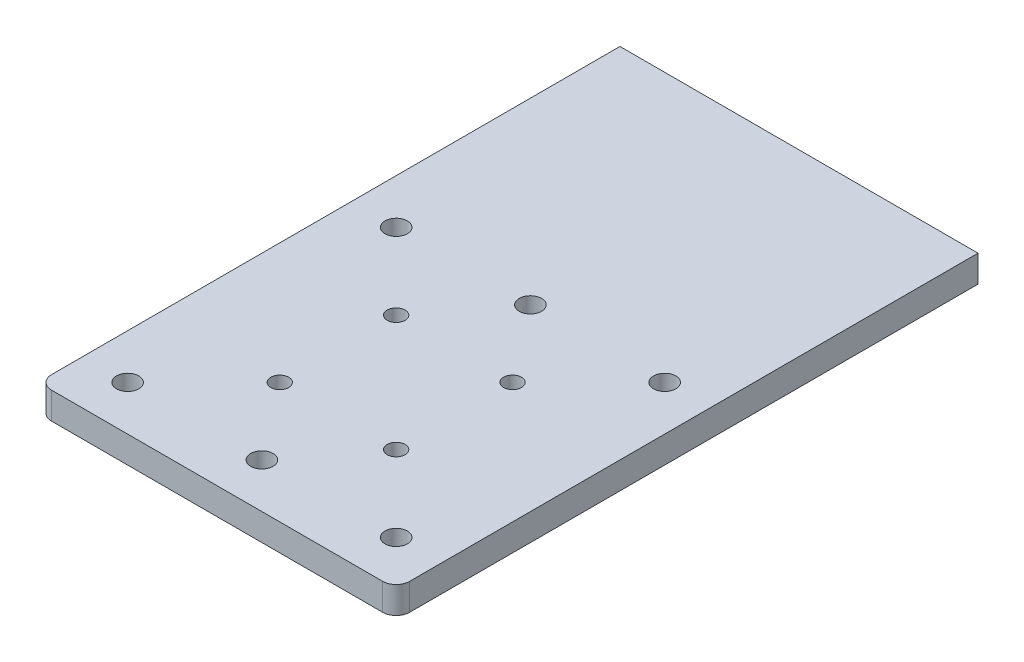
ISO-10303-21;
HEADER;
FILE_DESCRIPTION(('STEP AP214'),'2;1');
FILE_NAME('part.step','',(''),(''),'','','');
FILE_SCHEMA(('AUTOMOTIVE_DESIGN { 1 0 10303 214 1 1 1 1 }'));
ENDSEC;
DATA;
#1=APPLICATION_CONTEXT('core data for automotive mechanical design processes');
#2=APPLICATION_PROTOCOL_DEFINITION('international standard','automotive_design',2000,#1);
#3=PRODUCT_CONTEXT('',#1,'mechanical');
#4=PRODUCT('Part','Part','',(#3));
#5=PRODUCT_RELATED_PRODUCT_CATEGORY('part','',(#4));
#6=PRODUCT_DEFINITION_FORMATION('','',#4);
#7=PRODUCT_DEFINITION_CONTEXT('part definition',#1,'design');
#8=PRODUCT_DEFINITION('design','',#6,#7);
#9=PRODUCT_DEFINITION_SHAPE('','',#8);
#10=(LENGTH_UNIT() NAMED_UNIT(*) SI_UNIT(.MILLI.,.METRE.));
#11=(NAMED_UNIT(*) PLANE_ANGLE_UNIT() SI_UNIT($,.RADIAN.));
#12=(NAMED_UNIT(*) SI_UNIT($,.STERADIAN.) SOLID_ANGLE_UNIT());
#13=UNCERTAINTY_MEASURE_WITH_UNIT(LENGTH_MEASURE(1.E-05),#10,'distance_accuracy_value','');
#14=(GEOMETRIC_REPRESENTATION_CONTEXT(3) GLOBAL_UNCERTAINTY_ASSIGNED_CONTEXT((#13)) GLOBAL_UNIT_ASSIGNED_CONTEXT((#10,
#11,#12)) REPRESENTATION_CONTEXT('',''));
#15=CARTESIAN_POINT('',(0.,0.,0.));
#16=DIRECTION('',(0.,0.,1.));
#17=DIRECTION('',(1.,0.,0.));
#18=AXIS2_PLACEMENT_3D('',#15,#16,#17);
#19=CARTESIAN_POINT('',(0.,6.,0.));
#20=DIRECTION('',(0.,1.,0.));
#21=DIRECTION('',(0.,0.,1.));
#22=AXIS2_PLACEMENT_3D('',#19,#20,#21);
#23=PLANE('',#22);
#24=CARTESIAN_POINT('',(13.,6.,-43.));
#25=DIRECTION('',(0.,1.,0.));
#26=DIRECTION('',(0.,0.,1.));
#27=AXIS2_PLACEMENT_3D('',#24,#25,#26);
#28=CIRCLE('',#27,2.5);
#29=CARTESIAN_POINT('',(13.,6.,-40.5));
#30=VERTEX_POINT('',#29);
#31=EDGE_CURVE('E192',#30,#30,#28,.T.);
#32=ORIENTED_EDGE('',*,*,#31,.F.);
#33=EDGE_LOOP('',(#32));
#34=FACE_BOUND('',#33,.T.);
#35=CARTESIAN_POINT('',(43.,6.,17.));
#36=DIRECTION('',(0.,1.,0.));
#37=DIRECTION('',(0.,0.,1.));
#38=AXIS2_PLACEMENT_3D('',#35,#36,#37);
#39=CIRCLE('',#38,2.5);
#40=CARTESIAN_POINT('',(43.,6.,19.5));
#41=VERTEX_POINT('',#40);
#42=EDGE_CURVE('E180',#41,#41,#39,.T.);
#43=ORIENTED_EDGE('',*,*,#42,.F.);
#44=EDGE_LOOP('',(#43));
#45=FACE_BOUND('',#44,.T.);
#46=CARTESIAN_POINT('',(-17.,6.,-43.));
#47=DIRECTION('',(0.,1.,0.));
#48=DIRECTION('',(0.,0.,1.));
#49=AXIS2_PLACEMENT_3D('',#46,#47,#48);
#50=CIRCLE('',#49,2.5);
#51=CARTESIAN_POINT('',(-17.,6.,-40.5));
#52=VERTEX_POINT('',#51);
#53=EDGE_CURVE('E168',#52,#52,#50,.T.);
#54=ORIENTED_EDGE('',*,*,#53,.F.);
#55=EDGE_LOOP('',(#54));
#56=FACE_BOUND('',#55,.T.);
#57=CARTESIAN_POINT('',(26.,6.,0.));
#58=DIRECTION('',(0.,1.,0.));
#59=DIRECTION('',(0.,0.,1.));
#60=AXIS2_PLACEMENT_3D('',#57,#58,#59);
#61=CIRCLE('',#60,2.);
#62=CARTESIAN_POINT('',(26.,6.,2.));
#63=VERTEX_POINT('',#62);
#64=EDGE_CURVE('E156',#63,#63,#61,.T.);
#65=ORIENTED_EDGE('',*,*,#64,.F.);
#66=EDGE_LOOP('',(#65));
#67=FACE_BOUND('',#66,.T.);
#68=CARTESIAN_POINT('',(0.,6.,-26.));
#69=DIRECTION('',(0.,1.,0.));
#70=DIRECTION('',(0.,0.,1.));
#71=AXIS2_PLACEMENT_3D('',#68,#69,#70);
#72=CIRCLE('',#71,2.);
#73=CARTESIAN_POINT('',(0.,6.,-24.));
#74=VERTEX_POINT('',#73);
#75=EDGE_CURVE('E119',#74,#74,#72,.T.);
#76=ORIENTED_EDGE('',*,*,#75,.F.);
#77=EDGE_LOOP('',(#76));
#78=FACE_BOUND('',#77,.T.);
#79=DIRECTION('',(1.,0.,0.));
#80=VECTOR('',#79,1.);
#81=CARTESIAN_POINT('',(-27.,6.,27.));
#82=LINE('',#81,#80);
#83=CARTESIAN_POINT('',(-24.,6.,27.));
#84=VERTEX_POINT('',#83);
#85=CARTESIAN_POINT('',(50.,6.,27.));
#86=VERTEX_POINT('',#85);
#87=EDGE_CURVE('E98',#84,#86,#82,.T.);
#88=ORIENTED_EDGE('',*,*,#87,.T.);
#89=CARTESIAN_POINT('',(50.,6.,24.));
#90=DIRECTION('',(0.,1.,0.));
#91=DIRECTION('',(0.,0.,1.));
#92=AXIS2_PLACEMENT_3D('',#89,#90,#91);
#93=CIRCLE('',#92,3.);
#94=CARTESIAN_POINT('',(53.,6.,24.));
#95=VERTEX_POINT('',#94);
#96=EDGE_CURVE('E42',#86,#95,#93,.T.);
#97=ORIENTED_EDGE('',*,*,#96,.T.);
#98=DIRECTION('',(0.,0.,-1.));
#99=VECTOR('',#98,1.);
#100=CARTESIAN_POINT('',(53.,6.,-103.));
#101=LINE('',#100,#99);
#102=CARTESIAN_POINT('',(53.,6.,-103.));
#103=VERTEX_POINT('',#102);
#104=EDGE_CURVE('E88',#95,#103,#101,.T.);
#105=ORIENTED_EDGE('',*,*,#104,.T.);
#106=DIRECTION('',(-1.,0.,0.));
#107=VECTOR('',#106,1.);
#108=CARTESIAN_POINT('',(-27.,6.,-103.));
#109=LINE('',#108,#107);
#110=CARTESIAN_POINT('',(-27.,6.,-103.));
#111=VERTEX_POINT('',#110);
#112=EDGE_CURVE('E92',#103,#111,#109,.T.);
#113=ORIENTED_EDGE('',*,*,#112,.T.);
#114=DIRECTION('',(0.,0.,1.));
#115=VECTOR('',#114,1.);
#116=CARTESIAN_POINT('',(-27.,6.,-103.));
#117=LINE('',#116,#115);
#118=CARTESIAN_POINT('',(-27.,6.,24.));
#119=VERTEX_POINT('',#118);
#120=EDGE_CURVE('E123',#111,#119,#117,.T.);
#121=ORIENTED_EDGE('',*,*,#120,.T.);
#122=CARTESIAN_POINT('',(-24.,6.,24.));
#123=DIRECTION('',(0.,1.,0.));
#124=DIRECTION('',(0.,0.,1.));
#125=AXIS2_PLACEMENT_3D('',#122,#123,#124);
#126=CIRCLE('',#125,3.);
#127=EDGE_CURVE('E134',#119,#84,#126,.T.);
#128=ORIENTED_EDGE('',*,*,#127,.T.);
#129=EDGE_LOOP('',(#88,#97,#105,#113,#121,#128));
#130=FACE_BOUND('',#129,.T.);
#131=CARTESIAN_POINT('',(26.,6.,-26.));
#132=DIRECTION('',(0.,1.,0.));
#133=DIRECTION('',(0.,0.,1.));
#134=AXIS2_PLACEMENT_3D('',#131,#132,#133);
#135=CIRCLE('',#134,2.);
#136=CARTESIAN_POINT('',(26.,6.,-24.));
#137=VERTEX_POINT('',#136);
#138=EDGE_CURVE('E150',#137,#137,#135,.T.);
#139=ORIENTED_EDGE('',*,*,#138,.F.);
#140=EDGE_LOOP('',(#139));
#141=FACE_BOUND('',#140,.T.);
#142=CARTESIAN_POINT('',(0.,6.,0.));
#143=DIRECTION('',(0.,1.,0.));
#144=DIRECTION('',(0.,0.,1.));
#145=AXIS2_PLACEMENT_3D('',#142,#143,#144);
#146=CIRCLE('',#145,2.);
#147=CARTESIAN_POINT('',(0.,6.,2.));
#148=VERTEX_POINT('',#147);
#149=EDGE_CURVE('E162',#148,#148,#146,.T.);
#150=ORIENTED_EDGE('',*,*,#149,.F.);
#151=EDGE_LOOP('',(#150));
#152=FACE_BOUND('',#151,.T.);
#153=CARTESIAN_POINT('',(43.,6.,-43.));
#154=DIRECTION('',(0.,1.,0.));
#155=DIRECTION('',(0.,0.,1.));
#156=AXIS2_PLACEMENT_3D('',#153,#154,#155);
#157=CIRCLE('',#156,2.5);
#158=CARTESIAN_POINT('',(43.,6.,-40.5));
#159=VERTEX_POINT('',#158);
#160=EDGE_CURVE('E174',#159,#159,#157,.T.);
#161=ORIENTED_EDGE('',*,*,#160,.F.);
#162=EDGE_LOOP('',(#161));
#163=FACE_BOUND('',#162,.T.);
#164=CARTESIAN_POINT('',(-17.,6.,17.));
#165=DIRECTION('',(0.,1.,0.));
#166=DIRECTION('',(0.,0.,1.));
#167=AXIS2_PLACEMENT_3D('',#164,#165,#166);
#168=CIRCLE('',#167,2.5);
#169=CARTESIAN_POINT('',(-17.,6.,19.5));
#170=VERTEX_POINT('',#169);
#171=EDGE_CURVE('E186',#170,#170,#168,.T.);
#172=ORIENTED_EDGE('',*,*,#171,.F.);
#173=EDGE_LOOP('',(#172));
#174=FACE_BOUND('',#173,.T.);
#175=CARTESIAN_POINT('',(13.,6.,17.));
#176=DIRECTION('',(0.,1.,0.));
#177=DIRECTION('',(0.,0.,1.));
#178=AXIS2_PLACEMENT_3D('',#175,#176,#177);
#179=CIRCLE('',#178,2.5);
#180=CARTESIAN_POINT('',(13.,6.,19.5));
#181=VERTEX_POINT('',#180);
#182=EDGE_CURVE('E198',#181,#181,#179,.T.);
#183=ORIENTED_EDGE('',*,*,#182,.F.);
#184=EDGE_LOOP('',(#183));
#185=FACE_BOUND('',#184,.T.);
#186=ADVANCED_FACE('F34',(#34,#45,#56,#67,#78,#130,#141,#152,#163,#174,#185),#23,.T.);
#187=CARTESIAN_POINT('',(0.,0.,0.));
#188=DIRECTION('',(0.,1.,0.));
#189=DIRECTION('',(0.,0.,1.));
#190=AXIS2_PLACEMENT_3D('',#187,#188,#189);
#191=PLANE('',#190);
#192=CARTESIAN_POINT('',(13.,0.,-43.));
#193=DIRECTION('',(0.,1.,0.));
#194=DIRECTION('',(0.,0.,1.));
#195=AXIS2_PLACEMENT_3D('',#192,#193,#194);
#196=CIRCLE('',#195,2.5);
#197=CARTESIAN_POINT('',(13.,0.,-40.5));
#198=VERTEX_POINT('',#197);
#199=EDGE_CURVE('E195',#198,#198,#196,.T.);
#200=ORIENTED_EDGE('',*,*,#199,.T.);
#201=EDGE_LOOP('',(#200));
#202=FACE_BOUND('',#201,.T.);
#203=CARTESIAN_POINT('',(43.,0.,17.));
#204=DIRECTION('',(0.,1.,0.));
#205=DIRECTION('',(0.,0.,1.));
#206=AXIS2_PLACEMENT_3D('',#203,#204,#205);
#207=CIRCLE('',#206,2.5);
#208=CARTESIAN_POINT('',(43.,0.,19.5));
#209=VERTEX_POINT('',#208);
#210=EDGE_CURVE('E183',#209,#209,#207,.T.);
#211=ORIENTED_EDGE('',*,*,#210,.T.);
#212=EDGE_LOOP('',(#211));
#213=FACE_BOUND('',#212,.T.);
#214=CARTESIAN_POINT('',(-17.,0.,-43.));
#215=DIRECTION('',(0.,1.,0.));
#216=DIRECTION('',(0.,0.,1.));
#217=AXIS2_PLACEMENT_3D('',#214,#215,#216);
#218=CIRCLE('',#217,2.5);
#219=CARTESIAN_POINT('',(-17.,0.,-40.5));
#220=VERTEX_POINT('',#219);
#221=EDGE_CURVE('E171',#220,#220,#218,.T.);
#222=ORIENTED_EDGE('',*,*,#221,.T.);
#223=EDGE_LOOP('',(#222));
#224=FACE_BOUND('',#223,.T.);
#225=CARTESIAN_POINT('',(26.,0.,0.));
#226=DIRECTION('',(0.,1.,0.));
#227=DIRECTION('',(0.,0.,1.));
#228=AXIS2_PLACEMENT_3D('',#225,#226,#227);
#229=CIRCLE('',#228,2.);
#230=CARTESIAN_POINT('',(26.,0.,2.));
#231=VERTEX_POINT('',#230);
#232=EDGE_CURVE('E159',#231,#231,#229,.T.);
#233=ORIENTED_EDGE('',*,*,#232,.T.);
#234=EDGE_LOOP('',(#233));
#235=FACE_BOUND('',#234,.T.);
#236=CARTESIAN_POINT('',(0.,0.,-26.));
#237=DIRECTION('',(0.,1.,0.));
#238=DIRECTION('',(0.,0.,1.));
#239=AXIS2_PLACEMENT_3D('',#236,#237,#238);
#240=CIRCLE('',#239,2.);
#241=CARTESIAN_POINT('',(0.,0.,-24.));
#242=VERTEX_POINT('',#241);
#243=EDGE_CURVE('E147',#242,#242,#240,.T.);
#244=ORIENTED_EDGE('',*,*,#243,.T.);
#245=EDGE_LOOP('',(#244));
#246=FACE_BOUND('',#245,.T.);
#247=DIRECTION('',(0.,0.,-1.));
#248=VECTOR('',#247,1.);
#249=CARTESIAN_POINT('',(53.,0.,-103.));
#250=LINE('',#249,#248);
#251=CARTESIAN_POINT('',(53.,0.,24.));
#252=VERTEX_POINT('',#251);
#253=CARTESIAN_POINT('',(53.,0.,-103.));
#254=VERTEX_POINT('',#253);
#255=EDGE_CURVE('E104',#252,#254,#250,.T.);
#256=ORIENTED_EDGE('',*,*,#255,.F.);
#257=CARTESIAN_POINT('',(50.,0.,24.));
#258=DIRECTION('',(0.,1.,0.));
#259=DIRECTION('',(0.,0.,1.));
#260=AXIS2_PLACEMENT_3D('',#257,#258,#259);
#261=CIRCLE('',#260,3.);
#262=CARTESIAN_POINT('',(50.,0.,27.));
#263=VERTEX_POINT('',#262);
#264=EDGE_CURVE('E128',#252,#263,#261,.F.);
#265=ORIENTED_EDGE('',*,*,#264,.T.);
#266=DIRECTION('',(1.,0.,0.));
#267=VECTOR('',#266,1.);
#268=CARTESIAN_POINT('',(-27.,0.,27.));
#269=LINE('',#268,#267);
#270=CARTESIAN_POINT('',(-24.,0.,27.));
#271=VERTEX_POINT('',#270);
#272=EDGE_CURVE('E118',#271,#263,#269,.T.);
#273=ORIENTED_EDGE('',*,*,#272,.F.);
#274=CARTESIAN_POINT('',(-24.,0.,24.));
#275=DIRECTION('',(0.,1.,0.));
#276=DIRECTION('',(0.,0.,1.));
#277=AXIS2_PLACEMENT_3D('',#274,#275,#276);
#278=CIRCLE('',#277,3.);
#279=CARTESIAN_POINT('',(-27.,0.,24.));
#280=VERTEX_POINT('',#279);
#281=EDGE_CURVE('E126',#271,#280,#278,.F.);
#282=ORIENTED_EDGE('',*,*,#281,.T.);
#283=DIRECTION('',(0.,0.,1.));
#284=VECTOR('',#283,1.);
#285=CARTESIAN_POINT('',(-27.,0.,-103.));
#286=LINE('',#285,#284);
#287=CARTESIAN_POINT('',(-27.,0.,-103.));
#288=VERTEX_POINT('',#287);
#289=EDGE_CURVE('E116',#288,#280,#286,.T.);
#290=ORIENTED_EDGE('',*,*,#289,.F.);
#291=DIRECTION('',(-1.,0.,0.));
#292=VECTOR('',#291,1.);
#293=CARTESIAN_POINT('',(-27.,0.,-103.));
#294=LINE('',#293,#292);
#295=EDGE_CURVE('E122',#254,#288,#294,.T.);
#296=ORIENTED_EDGE('',*,*,#295,.F.);
#297=EDGE_LOOP('',(#256,#265,#273,#282,#290,#296));
#298=FACE_BOUND('',#297,.T.);
#299=CARTESIAN_POINT('',(26.,0.,-26.));
#300=DIRECTION('',(0.,1.,0.));
#301=DIRECTION('',(0.,0.,1.));
#302=AXIS2_PLACEMENT_3D('',#299,#300,#301);
#303=CIRCLE('',#302,2.);
#304=CARTESIAN_POINT('',(26.,0.,-24.));
#305=VERTEX_POINT('',#304);
#306=EDGE_CURVE('E153',#305,#305,#303,.T.);
#307=ORIENTED_EDGE('',*,*,#306,.T.);
#308=EDGE_LOOP('',(#307));
#309=FACE_BOUND('',#308,.T.);
#310=CARTESIAN_POINT('',(0.,0.,0.));
#311=DIRECTION('',(0.,1.,0.));
#312=DIRECTION('',(0.,0.,1.));
#313=AXIS2_PLACEMENT_3D('',#310,#311,#312);
#314=CIRCLE('',#313,2.);
#315=CARTESIAN_POINT('',(0.,0.,2.));
#316=VERTEX_POINT('',#315);
#317=EDGE_CURVE('E165',#316,#316,#314,.T.);
#318=ORIENTED_EDGE('',*,*,#317,.T.);
#319=EDGE_LOOP('',(#318));
#320=FACE_BOUND('',#319,.T.);
#321=CARTESIAN_POINT('',(43.,0.,-43.));
#322=DIRECTION('',(0.,1.,0.));
#323=DIRECTION('',(0.,0.,1.));
#324=AXIS2_PLACEMENT_3D('',#321,#322,#323);
#325=CIRCLE('',#324,2.5);
#326=CARTESIAN_POINT('',(43.,0.,-40.5));
#327=VERTEX_POINT('',#326);
#328=EDGE_CURVE('E177',#327,#327,#325,.T.);
#329=ORIENTED_EDGE('',*,*,#328,.T.);
#330=EDGE_LOOP('',(#329));
#331=FACE_BOUND('',#330,.T.);
#332=CARTESIAN_POINT('',(-17.,0.,17.));
#333=DIRECTION('',(0.,1.,0.));
#334=DIRECTION('',(0.,0.,1.));
#335=AXIS2_PLACEMENT_3D('',#332,#333,#334);
#336=CIRCLE('',#335,2.5);
#337=CARTESIAN_POINT('',(-17.,0.,19.5));
#338=VERTEX_POINT('',#337);
#339=EDGE_CURVE('E189',#338,#338,#336,.T.);
#340=ORIENTED_EDGE('',*,*,#339,.T.);
#341=EDGE_LOOP('',(#340));
#342=FACE_BOUND('',#341,.T.);
#343=CARTESIAN_POINT('',(13.,0.,17.));
#344=DIRECTION('',(0.,1.,0.));
#345=DIRECTION('',(0.,0.,1.));
#346=AXIS2_PLACEMENT_3D('',#343,#344,#345);
#347=CIRCLE('',#346,2.5);
#348=CARTESIAN_POINT('',(13.,0.,19.5));
#349=VERTEX_POINT('',#348);
#350=EDGE_CURVE('E201',#349,#349,#347,.T.);
#351=ORIENTED_EDGE('',*,*,#350,.T.);
#352=EDGE_LOOP('',(#351));
#353=FACE_BOUND('',#352,.T.);
#354=ADVANCED_FACE('F142',(#202,#213,#224,#235,#246,#298,#309,#320,#331,#342,#353),#191,.F.);
#355=CARTESIAN_POINT('',(-27.,6.,-103.));
#356=DIRECTION('',(1.,0.,0.));
#357=DIRECTION('',(0.,0.,-1.));
#358=AXIS2_PLACEMENT_3D('',#355,#356,#357);
#359=PLANE('',#358);
#360=ORIENTED_EDGE('',*,*,#289,.T.);
#361=DIRECTION('',(0.,-1.,0.));
#362=VECTOR('',#361,1.);
#363=CARTESIAN_POINT('',(-27.,6.,24.));
#364=LINE('',#363,#362);
#365=EDGE_CURVE('E11',#280,#119,#364,.F.);
#366=ORIENTED_EDGE('',*,*,#365,.T.);
#367=ORIENTED_EDGE('',*,*,#120,.F.);
#368=DIRECTION('',(0.,-1.,0.));
#369=VECTOR('',#368,1.);
#370=CARTESIAN_POINT('',(-27.,6.,-103.));
#371=LINE('',#370,#369);
#372=EDGE_CURVE('E108',#111,#288,#371,.T.);
#373=ORIENTED_EDGE('',*,*,#372,.T.);
#374=EDGE_LOOP('',(#360,#366,#367,#373));
#375=FACE_BOUND('',#374,.T.);
#376=ADVANCED_FACE('F144',(#375),#359,.F.);
#377=CARTESIAN_POINT('',(-27.,6.,27.));
#378=DIRECTION('',(0.,0.,-1.));
#379=DIRECTION('',(-1.,0.,0.));
#380=AXIS2_PLACEMENT_3D('',#377,#378,#379);
#381=PLANE('',#380);
#382=ORIENTED_EDGE('',*,*,#272,.T.);
#383=DIRECTION('',(0.,-1.,0.));
#384=VECTOR('',#383,1.);
#385=CARTESIAN_POINT('',(50.,6.,27.));
#386=LINE('',#385,#384);
#387=EDGE_CURVE('E55',#263,#86,#386,.F.);
#388=ORIENTED_EDGE('',*,*,#387,.T.);
#389=ORIENTED_EDGE('',*,*,#87,.F.);
#390=DIRECTION('',(0.,-1.,0.));
#391=VECTOR('',#390,1.);
#392=CARTESIAN_POINT('',(-24.,6.,27.));
#393=LINE('',#392,#391);
#394=EDGE_CURVE('E130',#84,#271,#393,.T.);
#395=ORIENTED_EDGE('',*,*,#394,.T.);
#396=EDGE_LOOP('',(#382,#388,#389,#395));
#397=FACE_BOUND('',#396,.T.);
#398=ADVANCED_FACE('F138',(#397),#381,.F.);
#399=CARTESIAN_POINT('',(53.,6.,-103.));
#400=DIRECTION('',(-1.,0.,0.));
#401=DIRECTION('',(0.,0.,1.));
#402=AXIS2_PLACEMENT_3D('',#399,#400,#401);
#403=PLANE('',#402);
#404=ORIENTED_EDGE('',*,*,#104,.F.);
#405=DIRECTION('',(0.,-1.,0.));
#406=VECTOR('',#405,1.);
#407=CARTESIAN_POINT('',(53.,6.,24.));
#408=LINE('',#407,#406);
#409=EDGE_CURVE('E107',#95,#252,#408,.T.);
#410=ORIENTED_EDGE('',*,*,#409,.T.);
#411=ORIENTED_EDGE('',*,*,#255,.T.);
#412=DIRECTION('',(0.,-1.,0.));
#413=VECTOR('',#412,1.);
#414=CARTESIAN_POINT('',(53.,6.,-103.));
#415=LINE('',#414,#413);
#416=EDGE_CURVE('E101',#103,#254,#415,.T.);
#417=ORIENTED_EDGE('',*,*,#416,.F.);
#418=EDGE_LOOP('',(#404,#410,#411,#417));
#419=FACE_BOUND('',#418,.T.);
#420=ADVANCED_FACE('F102',(#419),#403,.F.);
#421=CARTESIAN_POINT('',(-27.,6.,-103.));
#422=DIRECTION('',(0.,0.,1.));
#423=DIRECTION('',(1.,0.,0.));
#424=AXIS2_PLACEMENT_3D('',#421,#422,#423);
#425=PLANE('',#424);
#426=ORIENTED_EDGE('',*,*,#295,.T.);
#427=ORIENTED_EDGE('',*,*,#372,.F.);
#428=ORIENTED_EDGE('',*,*,#112,.F.);
#429=ORIENTED_EDGE('',*,*,#416,.T.);
#430=EDGE_LOOP('',(#426,#427,#428,#429));
#431=FACE_BOUND('',#430,.T.);
#432=ADVANCED_FACE('F110',(#431),#425,.F.);
#433=CARTESIAN_POINT('',(0.,6.,-26.));
#434=DIRECTION('',(0.,-1.,0.));
#435=DIRECTION('',(0.,0.,-1.));
#436=AXIS2_PLACEMENT_3D('',#433,#434,#435);
#437=CYLINDRICAL_SURFACE('',#436,2.);
#438=ORIENTED_EDGE('',*,*,#75,.T.);
#439=EDGE_LOOP('',(#438));
#440=FACE_BOUND('',#439,.T.);
#441=ORIENTED_EDGE('',*,*,#243,.F.);
#442=EDGE_LOOP('',(#441));
#443=FACE_BOUND('',#442,.T.);
#444=ADVANCED_FACE('F221',(#440,#443),#437,.F.);
#445=CARTESIAN_POINT('',(26.,6.,-26.));
#446=DIRECTION('',(0.,-1.,0.));
#447=DIRECTION('',(0.,0.,-1.));
#448=AXIS2_PLACEMENT_3D('',#445,#446,#447);
#449=CYLINDRICAL_SURFACE('',#448,2.);
#450=ORIENTED_EDGE('',*,*,#138,.T.);
#451=EDGE_LOOP('',(#450));
#452=FACE_BOUND('',#451,.T.);
#453=ORIENTED_EDGE('',*,*,#306,.F.);
#454=EDGE_LOOP('',(#453));
#455=FACE_BOUND('',#454,.T.);
#456=ADVANCED_FACE('F268',(#452,#455),#449,.F.);
#457=CARTESIAN_POINT('',(26.,6.,0.));
#458=DIRECTION('',(0.,-1.,0.));
#459=DIRECTION('',(0.,0.,-1.));
#460=AXIS2_PLACEMENT_3D('',#457,#458,#459);
#461=CYLINDRICAL_SURFACE('',#460,2.);
#462=ORIENTED_EDGE('',*,*,#64,.T.);
#463=EDGE_LOOP('',(#462));
#464=FACE_BOUND('',#463,.T.);
#465=ORIENTED_EDGE('',*,*,#232,.F.);
#466=EDGE_LOOP('',(#465));
#467=FACE_BOUND('',#466,.T.);
#468=ADVANCED_FACE('F265',(#464,#467),#461,.F.);
#469=CARTESIAN_POINT('',(0.,6.,0.));
#470=DIRECTION('',(0.,-1.,0.));
#471=DIRECTION('',(0.,0.,-1.));
#472=AXIS2_PLACEMENT_3D('',#469,#470,#471);
#473=CYLINDRICAL_SURFACE('',#472,2.);
#474=ORIENTED_EDGE('',*,*,#149,.T.);
#475=EDGE_LOOP('',(#474));
#476=FACE_BOUND('',#475,.T.);
#477=ORIENTED_EDGE('',*,*,#317,.F.);
#478=EDGE_LOOP('',(#477));
#479=FACE_BOUND('',#478,.T.);
#480=ADVANCED_FACE('F261',(#476,#479),#473,.F.);
#481=CARTESIAN_POINT('',(-17.,6.,-43.));
#482=DIRECTION('',(0.,-1.,0.));
#483=DIRECTION('',(0.,0.,-1.));
#484=AXIS2_PLACEMENT_3D('',#481,#482,#483);
#485=CYLINDRICAL_SURFACE('',#484,2.5);
#486=ORIENTED_EDGE('',*,*,#53,.T.);
#487=EDGE_LOOP('',(#486));
#488=FACE_BOUND('',#487,.T.);
#489=ORIENTED_EDGE('',*,*,#221,.F.);
#490=EDGE_LOOP('',(#489));
#491=FACE_BOUND('',#490,.T.);
#492=ADVANCED_FACE('F257',(#488,#491),#485,.F.);
#493=CARTESIAN_POINT('',(43.,6.,-43.));
#494=DIRECTION('',(0.,-1.,0.));
#495=DIRECTION('',(0.,0.,-1.));
#496=AXIS2_PLACEMENT_3D('',#493,#494,#495);
#497=CYLINDRICAL_SURFACE('',#496,2.5);
#498=ORIENTED_EDGE('',*,*,#160,.T.);
#499=EDGE_LOOP('',(#498));
#500=FACE_BOUND('',#499,.T.);
#501=ORIENTED_EDGE('',*,*,#328,.F.);
#502=EDGE_LOOP('',(#501));
#503=FACE_BOUND('',#502,.T.);
#504=ADVANCED_FACE('F253',(#500,#503),#497,.F.);
#505=CARTESIAN_POINT('',(43.,6.,17.));
#506=DIRECTION('',(0.,-1.,0.));
#507=DIRECTION('',(0.,0.,-1.));
#508=AXIS2_PLACEMENT_3D('',#505,#506,#507);
#509=CYLINDRICAL_SURFACE('',#508,2.5);
#510=ORIENTED_EDGE('',*,*,#42,.T.);
#511=EDGE_LOOP('',(#510));
#512=FACE_BOUND('',#511,.T.);
#513=ORIENTED_EDGE('',*,*,#210,.F.);
#514=EDGE_LOOP('',(#513));
#515=FACE_BOUND('',#514,.T.);
#516=ADVANCED_FACE('F249',(#512,#515),#509,.F.);
#517=CARTESIAN_POINT('',(-17.,6.,17.));
#518=DIRECTION('',(0.,-1.,0.));
#519=DIRECTION('',(0.,0.,-1.));
#520=AXIS2_PLACEMENT_3D('',#517,#518,#519);
#521=CYLINDRICAL_SURFACE('',#520,2.5);
#522=ORIENTED_EDGE('',*,*,#171,.T.);
#523=EDGE_LOOP('',(#522));
#524=FACE_BOUND('',#523,.T.);
#525=ORIENTED_EDGE('',*,*,#339,.F.);
#526=EDGE_LOOP('',(#525));
#527=FACE_BOUND('',#526,.T.);
#528=ADVANCED_FACE('F243',(#524,#527),#521,.F.);
#529=CARTESIAN_POINT('',(13.,6.,-43.));
#530=DIRECTION('',(0.,-1.,0.));
#531=DIRECTION('',(0.,0.,-1.));
#532=AXIS2_PLACEMENT_3D('',#529,#530,#531);
#533=CYLINDRICAL_SURFACE('',#532,2.5);
#534=ORIENTED_EDGE('',*,*,#31,.T.);
#535=EDGE_LOOP('',(#534));
#536=FACE_BOUND('',#535,.T.);
#537=ORIENTED_EDGE('',*,*,#199,.F.);
#538=EDGE_LOOP('',(#537));
#539=FACE_BOUND('',#538,.T.);
#540=ADVANCED_FACE('F238',(#536,#539),#533,.F.);
#541=CARTESIAN_POINT('',(13.,6.,17.));
#542=DIRECTION('',(0.,-1.,0.));
#543=DIRECTION('',(0.,0.,-1.));
#544=AXIS2_PLACEMENT_3D('',#541,#542,#543);
#545=CYLINDRICAL_SURFACE('',#544,2.5);
#546=ORIENTED_EDGE('',*,*,#182,.T.);
#547=EDGE_LOOP('',(#546));
#548=FACE_BOUND('',#547,.T.);
#549=ORIENTED_EDGE('',*,*,#350,.F.);
#550=EDGE_LOOP('',(#549));
#551=FACE_BOUND('',#550,.T.);
#552=ADVANCED_FACE('F207',(#548,#551),#545,.F.);
#553=CARTESIAN_POINT('',(50.,6.,24.));
#554=DIRECTION('',(0.,-1.,0.));
#555=DIRECTION('',(0.,0.,-1.));
#556=AXIS2_PLACEMENT_3D('',#553,#554,#555);
#557=CYLINDRICAL_SURFACE('',#556,3.);
#558=ORIENTED_EDGE('',*,*,#96,.F.);
#559=ORIENTED_EDGE('',*,*,#387,.F.);
#560=ORIENTED_EDGE('',*,*,#264,.F.);
#561=ORIENTED_EDGE('',*,*,#409,.F.);
#562=EDGE_LOOP('',(#558,#559,#560,#561));
#563=FACE_BOUND('',#562,.T.);
#564=ADVANCED_FACE('F231',(#563),#557,.T.);
#565=CARTESIAN_POINT('',(-24.,6.,24.));
#566=DIRECTION('',(0.,-1.,0.));
#567=DIRECTION('',(0.,0.,-1.));
#568=AXIS2_PLACEMENT_3D('',#565,#566,#567);
#569=CYLINDRICAL_SURFACE('',#568,3.);
#570=ORIENTED_EDGE('',*,*,#127,.F.);
#571=ORIENTED_EDGE('',*,*,#365,.F.);
#572=ORIENTED_EDGE('',*,*,#281,.F.);
#573=ORIENTED_EDGE('',*,*,#394,.F.);
#574=EDGE_LOOP('',(#570,#571,#572,#573));
#575=FACE_BOUND('',#574,.T.);
#576=ADVANCED_FACE('F36',(#575),#569,.T.);
#577=CLOSED_SHELL('',(#186,#354,#376,#398,#420,#432,#444,#456,#468,#480,#492,#504,#516,#528,
#540,#552,#564,#576));
#578=MANIFOLD_SOLID_BREP('B2',#577);
#579=ADVANCED_BREP_SHAPE_REPRESENTATION('',(#18,#578),#14);
#580=SHAPE_DEFINITION_REPRESENTATION(#9,#579);
ENDSEC;
END-ISO-10303-21;
